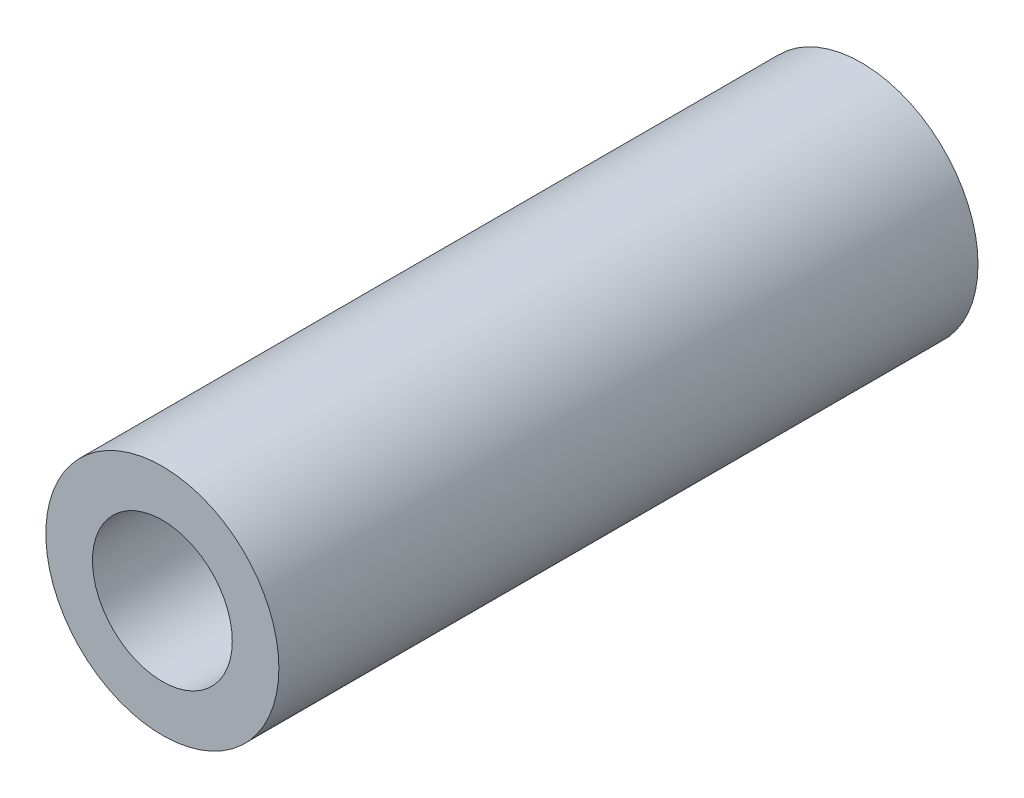
ISO-10303-21;
HEADER;
FILE_DESCRIPTION(('STEP AP214'),'2;1');
FILE_NAME('part.step','',(''),(''),'','','');
FILE_SCHEMA(('AUTOMOTIVE_DESIGN { 1 0 10303 214 1 1 1 1 }'));
ENDSEC;
DATA;
#1=APPLICATION_CONTEXT('core data for automotive mechanical design processes');
#2=APPLICATION_PROTOCOL_DEFINITION('international standard','automotive_design',2000,#1);
#3=PRODUCT_CONTEXT('',#1,'mechanical');
#4=PRODUCT('Part','Part','',(#3));
#5=PRODUCT_RELATED_PRODUCT_CATEGORY('part','',(#4));
#6=PRODUCT_DEFINITION_FORMATION('','',#4);
#7=PRODUCT_DEFINITION_CONTEXT('part definition',#1,'design');
#8=PRODUCT_DEFINITION('design','',#6,#7);
#9=PRODUCT_DEFINITION_SHAPE('','',#8);
#10=(LENGTH_UNIT() NAMED_UNIT(*) SI_UNIT(.MILLI.,.METRE.));
#11=(NAMED_UNIT(*) PLANE_ANGLE_UNIT() SI_UNIT($,.RADIAN.));
#12=(NAMED_UNIT(*) SI_UNIT($,.STERADIAN.) SOLID_ANGLE_UNIT());
#13=UNCERTAINTY_MEASURE_WITH_UNIT(LENGTH_MEASURE(1.E-05),#10,'distance_accuracy_value','');
#14=(GEOMETRIC_REPRESENTATION_CONTEXT(3) GLOBAL_UNCERTAINTY_ASSIGNED_CONTEXT((#13)) GLOBAL_UNIT_ASSIGNED_CONTEXT((#10,
#11,#12)) REPRESENTATION_CONTEXT('',''));
#15=CARTESIAN_POINT('',(0.,0.,0.));
#16=DIRECTION('',(0.,0.,1.));
#17=DIRECTION('',(1.,0.,0.));
#18=AXIS2_PLACEMENT_3D('',#15,#16,#17);
#19=CARTESIAN_POINT('',(0.,0.,0.));
#20=DIRECTION('',(0.,0.,1.));
#21=DIRECTION('',(1.,0.,0.));
#22=AXIS2_PLACEMENT_3D('',#19,#20,#21);
#23=CYLINDRICAL_SURFACE('',#22,1.5);
#24=CARTESIAN_POINT('',(0.,0.,-12.3));
#25=DIRECTION('',(0.,0.,1.));
#26=DIRECTION('',(1.,0.,0.));
#27=AXIS2_PLACEMENT_3D('',#24,#25,#26);
#28=CIRCLE('',#27,1.5);
#29=CARTESIAN_POINT('',(1.5,0.,-12.3));
#30=VERTEX_POINT('',#29);
#31=EDGE_CURVE('E67',#30,#30,#28,.T.);
#32=ORIENTED_EDGE('',*,*,#31,.F.);
#33=EDGE_LOOP('',(#32));
#34=FACE_BOUND('',#33,.T.);
#35=CARTESIAN_POINT('',(0.,0.,-10.));
#36=DIRECTION('',(0.,0.,1.));
#37=DIRECTION('',(1.,0.,0.));
#38=AXIS2_PLACEMENT_3D('',#35,#36,#37);
#39=CIRCLE('',#38,1.5);
#40=CARTESIAN_POINT('',(1.5,0.,-10.));
#41=VERTEX_POINT('',#40);
#42=EDGE_CURVE('E10',#41,#41,#39,.T.);
#43=ORIENTED_EDGE('',*,*,#42,.T.);
#44=EDGE_LOOP('',(#43));
#45=FACE_BOUND('',#44,.T.);
#46=ADVANCED_FACE('F33',(#34,#45),#23,.F.);
#47=CARTESIAN_POINT('',(-1.5,0.,-10.));
#48=DIRECTION('',(0.,0.,-1.));
#49=DIRECTION('',(-1.,0.,0.));
#50=AXIS2_PLACEMENT_3D('',#47,#48,#49);
#51=PLANE('',#50);
#52=ORIENTED_EDGE('',*,*,#42,.F.);
#53=EDGE_LOOP('',(#52));
#54=FACE_BOUND('',#53,.T.);
#55=CARTESIAN_POINT('',(0.,0.,-10.));
#56=DIRECTION('',(0.,0.,1.));
#57=DIRECTION('',(1.,0.,0.));
#58=AXIS2_PLACEMENT_3D('',#55,#56,#57);
#59=CIRCLE('',#58,2.5);
#60=CARTESIAN_POINT('',(2.5,0.,-10.));
#61=VERTEX_POINT('',#60);
#62=EDGE_CURVE('E39',#61,#61,#59,.T.);
#63=ORIENTED_EDGE('',*,*,#62,.T.);
#64=EDGE_LOOP('',(#63));
#65=FACE_BOUND('',#64,.T.);
#66=ADVANCED_FACE('F74',(#54,#65),#51,.F.);
#67=CARTESIAN_POINT('',(0.,0.,0.));
#68=DIRECTION('',(0.,0.,1.));
#69=DIRECTION('',(1.,0.,0.));
#70=AXIS2_PLACEMENT_3D('',#67,#68,#69);
#71=CYLINDRICAL_SURFACE('',#70,2.5);
#72=ORIENTED_EDGE('',*,*,#62,.F.);
#73=EDGE_LOOP('',(#72));
#74=FACE_BOUND('',#73,.T.);
#75=CARTESIAN_POINT('',(0.,0.,-25.));
#76=DIRECTION('',(0.,0.,1.));
#77=DIRECTION('',(1.,0.,0.));
#78=AXIS2_PLACEMENT_3D('',#75,#76,#77);
#79=CIRCLE('',#78,2.5);
#80=CARTESIAN_POINT('',(2.5,0.,-25.));
#81=VERTEX_POINT('',#80);
#82=EDGE_CURVE('E43',#81,#81,#79,.T.);
#83=ORIENTED_EDGE('',*,*,#82,.T.);
#84=EDGE_LOOP('',(#83));
#85=FACE_BOUND('',#84,.T.);
#86=ADVANCED_FACE('F78',(#74,#85),#71,.T.);
#87=CARTESIAN_POINT('',(-2.5,0.,-25.));
#88=DIRECTION('',(0.,0.,1.));
#89=DIRECTION('',(1.,0.,0.));
#90=AXIS2_PLACEMENT_3D('',#87,#88,#89);
#91=PLANE('',#90);
#92=ORIENTED_EDGE('',*,*,#82,.F.);
#93=EDGE_LOOP('',(#92));
#94=FACE_BOUND('',#93,.T.);
#95=CARTESIAN_POINT('',(0.,0.,-25.));
#96=DIRECTION('',(0.,0.,1.));
#97=DIRECTION('',(1.,0.,0.));
#98=AXIS2_PLACEMENT_3D('',#95,#96,#97);
#99=CIRCLE('',#98,0.999999999999998);
#100=CARTESIAN_POINT('',(0.999999999999998,0.,-25.));
#101=VERTEX_POINT('',#100);
#102=EDGE_CURVE('E47',#101,#101,#99,.T.);
#103=ORIENTED_EDGE('',*,*,#102,.T.);
#104=EDGE_LOOP('',(#103));
#105=FACE_BOUND('',#104,.T.);
#106=ADVANCED_FACE('F83',(#94,#105),#91,.F.);
#107=CARTESIAN_POINT('',(0.,0.,0.));
#108=DIRECTION('',(0.,0.,1.));
#109=DIRECTION('',(1.,0.,0.));
#110=AXIS2_PLACEMENT_3D('',#107,#108,#109);
#111=CYLINDRICAL_SURFACE('',#110,0.999999999999998);
#112=ORIENTED_EDGE('',*,*,#102,.F.);
#113=EDGE_LOOP('',(#112));
#114=FACE_BOUND('',#113,.T.);
#115=CARTESIAN_POINT('',(0.,0.,-24.5));
#116=DIRECTION('',(0.,0.,1.));
#117=DIRECTION('',(1.,0.,0.));
#118=AXIS2_PLACEMENT_3D('',#115,#116,#117);
#119=CIRCLE('',#118,0.999999999999998);
#120=CARTESIAN_POINT('',(0.999999999999998,0.,-24.5));
#121=VERTEX_POINT('',#120);
#122=EDGE_CURVE('E52',#121,#121,#119,.T.);
#123=ORIENTED_EDGE('',*,*,#122,.T.);
#124=EDGE_LOOP('',(#123));
#125=FACE_BOUND('',#124,.T.);
#126=ADVANCED_FACE('F89',(#114,#125),#111,.F.);
#127=CARTESIAN_POINT('',(-2.,0.,-24.5));
#128=DIRECTION('',(0.,0.,-1.));
#129=DIRECTION('',(-1.,0.,0.));
#130=AXIS2_PLACEMENT_3D('',#127,#128,#129);
#131=PLANE('',#130);
#132=ORIENTED_EDGE('',*,*,#122,.F.);
#133=EDGE_LOOP('',(#132));
#134=FACE_BOUND('',#133,.T.);
#135=CARTESIAN_POINT('',(0.,0.,-24.5));
#136=DIRECTION('',(0.,0.,1.));
#137=DIRECTION('',(1.,0.,0.));
#138=AXIS2_PLACEMENT_3D('',#135,#136,#137);
#139=CIRCLE('',#138,2.);
#140=CARTESIAN_POINT('',(2.,0.,-24.5));
#141=VERTEX_POINT('',#140);
#142=EDGE_CURVE('E55',#141,#141,#139,.T.);
#143=ORIENTED_EDGE('',*,*,#142,.T.);
#144=EDGE_LOOP('',(#143));
#145=FACE_BOUND('',#144,.T.);
#146=ADVANCED_FACE('F93',(#134,#145),#131,.F.);
#147=CARTESIAN_POINT('',(0.,0.,0.));
#148=DIRECTION('',(0.,0.,1.));
#149=DIRECTION('',(1.,0.,0.));
#150=AXIS2_PLACEMENT_3D('',#147,#148,#149);
#151=CYLINDRICAL_SURFACE('',#150,2.);
#152=ORIENTED_EDGE('',*,*,#142,.F.);
#153=EDGE_LOOP('',(#152));
#154=FACE_BOUND('',#153,.T.);
#155=CARTESIAN_POINT('',(0.,0.,-12.8));
#156=DIRECTION('',(0.,0.,1.));
#157=DIRECTION('',(1.,0.,0.));
#158=AXIS2_PLACEMENT_3D('',#155,#156,#157);
#159=CIRCLE('',#158,2.);
#160=CARTESIAN_POINT('',(2.,0.,-12.8));
#161=VERTEX_POINT('',#160);
#162=EDGE_CURVE('E58',#161,#161,#159,.T.);
#163=ORIENTED_EDGE('',*,*,#162,.T.);
#164=EDGE_LOOP('',(#163));
#165=FACE_BOUND('',#164,.T.);
#166=ADVANCED_FACE('F97',(#154,#165),#151,.F.);
#167=CARTESIAN_POINT('',(-2.,0.,-12.8));
#168=DIRECTION('',(0.,0.,1.));
#169=DIRECTION('',(1.,0.,0.));
#170=AXIS2_PLACEMENT_3D('',#167,#168,#169);
#171=PLANE('',#170);
#172=ORIENTED_EDGE('',*,*,#162,.F.);
#173=EDGE_LOOP('',(#172));
#174=FACE_BOUND('',#173,.T.);
#175=CARTESIAN_POINT('',(0.,0.,-12.8));
#176=DIRECTION('',(0.,0.,1.));
#177=DIRECTION('',(1.,0.,0.));
#178=AXIS2_PLACEMENT_3D('',#175,#176,#177);
#179=CIRCLE('',#178,1.);
#180=CARTESIAN_POINT('',(1.,0.,-12.8));
#181=VERTEX_POINT('',#180);
#182=EDGE_CURVE('E61',#181,#181,#179,.T.);
#183=ORIENTED_EDGE('',*,*,#182,.T.);
#184=EDGE_LOOP('',(#183));
#185=FACE_BOUND('',#184,.T.);
#186=ADVANCED_FACE('F101',(#174,#185),#171,.F.);
#187=CARTESIAN_POINT('',(0.,0.,0.));
#188=DIRECTION('',(0.,0.,1.));
#189=DIRECTION('',(1.,0.,0.));
#190=AXIS2_PLACEMENT_3D('',#187,#188,#189);
#191=CYLINDRICAL_SURFACE('',#190,1.);
#192=ORIENTED_EDGE('',*,*,#182,.F.);
#193=EDGE_LOOP('',(#192));
#194=FACE_BOUND('',#193,.T.);
#195=CARTESIAN_POINT('',(0.,0.,-12.3));
#196=DIRECTION('',(0.,0.,1.));
#197=DIRECTION('',(1.,0.,0.));
#198=AXIS2_PLACEMENT_3D('',#195,#196,#197);
#199=CIRCLE('',#198,1.);
#200=CARTESIAN_POINT('',(1.,0.,-12.3));
#201=VERTEX_POINT('',#200);
#202=EDGE_CURVE('E64',#201,#201,#199,.T.);
#203=ORIENTED_EDGE('',*,*,#202,.T.);
#204=EDGE_LOOP('',(#203));
#205=FACE_BOUND('',#204,.T.);
#206=ADVANCED_FACE('F105',(#194,#205),#191,.F.);
#207=CARTESIAN_POINT('',(-1.5,0.,-12.3));
#208=DIRECTION('',(0.,0.,-1.));
#209=DIRECTION('',(-1.,0.,0.));
#210=AXIS2_PLACEMENT_3D('',#207,#208,#209);
#211=PLANE('',#210);
#212=ORIENTED_EDGE('',*,*,#202,.F.);
#213=EDGE_LOOP('',(#212));
#214=FACE_BOUND('',#213,.T.);
#215=ORIENTED_EDGE('',*,*,#31,.T.);
#216=EDGE_LOOP('',(#215));
#217=FACE_BOUND('',#216,.T.);
#218=ADVANCED_FACE('F71',(#214,#217),#211,.F.);
#219=CLOSED_SHELL('',(#46,#66,#86,#106,#126,#146,#166,#186,#206,#218));
#220=MANIFOLD_SOLID_BREP('B2',#219);
#221=ADVANCED_BREP_SHAPE_REPRESENTATION('',(#18,#220),#14);
#222=SHAPE_DEFINITION_REPRESENTATION(#9,#221);
ENDSEC;
END-ISO-10303-21;
